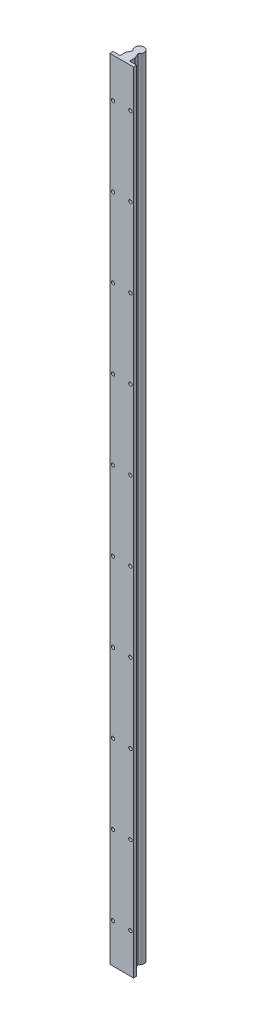
ISO-10303-21;
HEADER;
FILE_DESCRIPTION(('STEP AP214'),'2;1');
FILE_NAME('part.step','',(''),(''),'','','');
FILE_SCHEMA(('AUTOMOTIVE_DESIGN { 1 0 10303 214 1 1 1 1 }'));
ENDSEC;
DATA;
#1=APPLICATION_CONTEXT('core data for automotive mechanical design processes');
#2=APPLICATION_PROTOCOL_DEFINITION('international standard','automotive_design',2000,#1);
#3=PRODUCT_CONTEXT('',#1,'mechanical');
#4=PRODUCT('Part','Part','',(#3));
#5=PRODUCT_RELATED_PRODUCT_CATEGORY('part','',(#4));
#6=PRODUCT_DEFINITION_FORMATION('','',#4);
#7=PRODUCT_DEFINITION_CONTEXT('part definition',#1,'design');
#8=PRODUCT_DEFINITION('design','',#6,#7);
#9=PRODUCT_DEFINITION_SHAPE('','',#8);
#10=(LENGTH_UNIT() NAMED_UNIT(*) SI_UNIT(.MILLI.,.METRE.));
#11=(NAMED_UNIT(*) PLANE_ANGLE_UNIT() SI_UNIT($,.RADIAN.));
#12=(NAMED_UNIT(*) SI_UNIT($,.STERADIAN.) SOLID_ANGLE_UNIT());
#13=UNCERTAINTY_MEASURE_WITH_UNIT(LENGTH_MEASURE(1.E-05),#10,'distance_accuracy_value','');
#14=(GEOMETRIC_REPRESENTATION_CONTEXT(3) GLOBAL_UNCERTAINTY_ASSIGNED_CONTEXT((#13)) GLOBAL_UNIT_ASSIGNED_CONTEXT((#10,
#11,#12)) REPRESENTATION_CONTEXT('',''));
#15=CARTESIAN_POINT('',(0.,0.,0.));
#16=DIRECTION('',(0.,0.,1.));
#17=DIRECTION('',(1.,0.,0.));
#18=AXIS2_PLACEMENT_3D('',#15,#16,#17);
#19=CARTESIAN_POINT('',(-6.,1000.,18.5));
#20=DIRECTION('',(0.,0.,1.));
#21=DIRECTION('',(1.,0.,0.));
#22=AXIS2_PLACEMENT_3D('',#19,#20,#21);
#23=PLANE('',#22);
#24=CARTESIAN_POINT('',(-11.,350.,18.5));
#25=DIRECTION('',(0.,0.,-1.));
#26=DIRECTION('',(-1.,0.,0.));
#27=AXIS2_PLACEMENT_3D('',#24,#25,#26);
#28=CIRCLE('',#27,2.12500000000002);
#29=CARTESIAN_POINT('',(-13.125,350.,18.5));
#30=VERTEX_POINT('',#29);
#31=EDGE_CURVE('E300',#30,#30,#28,.T.);
#32=ORIENTED_EDGE('',*,*,#31,.F.);
#33=EDGE_LOOP('',(#32));
#34=FACE_BOUND('',#33,.T.);
#35=CARTESIAN_POINT('',(-11.,450.,18.5));
#36=DIRECTION('',(0.,0.,-1.));
#37=DIRECTION('',(-1.,0.,0.));
#38=AXIS2_PLACEMENT_3D('',#35,#36,#37);
#39=CIRCLE('',#38,2.12500000000002);
#40=CARTESIAN_POINT('',(-13.125,450.,18.5));
#41=VERTEX_POINT('',#40);
#42=EDGE_CURVE('E288',#41,#41,#39,.T.);
#43=ORIENTED_EDGE('',*,*,#42,.F.);
#44=EDGE_LOOP('',(#43));
#45=FACE_BOUND('',#44,.T.);
#46=CARTESIAN_POINT('',(-11.,150.,18.5));
#47=DIRECTION('',(0.,0.,-1.));
#48=DIRECTION('',(-1.,0.,0.));
#49=AXIS2_PLACEMENT_3D('',#46,#47,#48);
#50=CIRCLE('',#49,2.12500000000002);
#51=CARTESIAN_POINT('',(-13.125,150.,18.5));
#52=VERTEX_POINT('',#51);
#53=EDGE_CURVE('E324',#52,#52,#50,.T.);
#54=ORIENTED_EDGE('',*,*,#53,.F.);
#55=EDGE_LOOP('',(#54));
#56=FACE_BOUND('',#55,.T.);
#57=CARTESIAN_POINT('',(-11.,250.,18.5));
#58=DIRECTION('',(0.,0.,-1.));
#59=DIRECTION('',(-1.,0.,0.));
#60=AXIS2_PLACEMENT_3D('',#57,#58,#59);
#61=CIRCLE('',#60,2.12500000000002);
#62=CARTESIAN_POINT('',(-13.125,250.,18.5));
#63=VERTEX_POINT('',#62);
#64=EDGE_CURVE('E312',#63,#63,#61,.T.);
#65=ORIENTED_EDGE('',*,*,#64,.F.);
#66=EDGE_LOOP('',(#65));
#67=FACE_BOUND('',#66,.T.);
#68=CARTESIAN_POINT('',(-11.,750.,18.5));
#69=DIRECTION('',(0.,0.,-1.));
#70=DIRECTION('',(-1.,0.,0.));
#71=AXIS2_PLACEMENT_3D('',#68,#69,#70);
#72=CIRCLE('',#71,2.12500000000002);
#73=CARTESIAN_POINT('',(-13.125,750.,18.5));
#74=VERTEX_POINT('',#73);
#75=EDGE_CURVE('E252',#74,#74,#72,.T.);
#76=ORIENTED_EDGE('',*,*,#75,.F.);
#77=EDGE_LOOP('',(#76));
#78=FACE_BOUND('',#77,.T.);
#79=CARTESIAN_POINT('',(-11.,850.,18.5));
#80=DIRECTION('',(0.,0.,-1.));
#81=DIRECTION('',(-1.,0.,0.));
#82=AXIS2_PLACEMENT_3D('',#79,#80,#81);
#83=CIRCLE('',#82,2.12500000000002);
#84=CARTESIAN_POINT('',(-13.125,850.,18.5));
#85=VERTEX_POINT('',#84);
#86=EDGE_CURVE('E240',#85,#85,#83,.T.);
#87=ORIENTED_EDGE('',*,*,#86,.F.);
#88=EDGE_LOOP('',(#87));
#89=FACE_BOUND('',#88,.T.);
#90=CARTESIAN_POINT('',(-11.,550.,18.5));
#91=DIRECTION('',(0.,0.,-1.));
#92=DIRECTION('',(-1.,0.,0.));
#93=AXIS2_PLACEMENT_3D('',#90,#91,#92);
#94=CIRCLE('',#93,2.12500000000002);
#95=CARTESIAN_POINT('',(-13.125,550.,18.5));
#96=VERTEX_POINT('',#95);
#97=EDGE_CURVE('E276',#96,#96,#94,.T.);
#98=ORIENTED_EDGE('',*,*,#97,.F.);
#99=EDGE_LOOP('',(#98));
#100=FACE_BOUND('',#99,.T.);
#101=CARTESIAN_POINT('',(-11.,650.,18.5));
#102=DIRECTION('',(0.,0.,-1.));
#103=DIRECTION('',(-1.,0.,0.));
#104=AXIS2_PLACEMENT_3D('',#101,#102,#103);
#105=CIRCLE('',#104,2.12500000000002);
#106=CARTESIAN_POINT('',(-13.125,650.,18.5));
#107=VERTEX_POINT('',#106);
#108=EDGE_CURVE('E264',#107,#107,#105,.T.);
#109=ORIENTED_EDGE('',*,*,#108,.F.);
#110=EDGE_LOOP('',(#109));
#111=FACE_BOUND('',#110,.T.);
#112=CARTESIAN_POINT('',(-11.,49.9999999999999,18.5));
#113=DIRECTION('',(0.,0.,-1.));
#114=DIRECTION('',(-1.,0.,0.));
#115=AXIS2_PLACEMENT_3D('',#112,#113,#114);
#116=CIRCLE('',#115,2.12500000000002);
#117=CARTESIAN_POINT('',(-13.125,49.9999999999999,18.5));
#118=VERTEX_POINT('',#117);
#119=EDGE_CURVE('E329',#118,#118,#116,.T.);
#120=ORIENTED_EDGE('',*,*,#119,.F.);
#121=EDGE_LOOP('',(#120));
#122=FACE_BOUND('',#121,.T.);
#123=CARTESIAN_POINT('',(-11.,950.,18.5));
#124=DIRECTION('',(0.,0.,-1.));
#125=DIRECTION('',(-1.,0.,0.));
#126=AXIS2_PLACEMENT_3D('',#123,#124,#125);
#127=CIRCLE('',#126,2.12500000000002);
#128=CARTESIAN_POINT('',(-13.125,950.,18.5));
#129=VERTEX_POINT('',#128);
#130=EDGE_CURVE('E218',#129,#129,#127,.T.);
#131=ORIENTED_EDGE('',*,*,#130,.F.);
#132=EDGE_LOOP('',(#131));
#133=FACE_BOUND('',#132,.T.);
#134=DIRECTION('',(-1.,0.,0.));
#135=VECTOR('',#134,1.);
#136=CARTESIAN_POINT('',(-6.,0.,18.5));
#137=LINE('',#136,#135);
#138=CARTESIAN_POINT('',(-6.,0.,18.5));
#139=VERTEX_POINT('',#138);
#140=CARTESIAN_POINT('',(-15.,0.,18.5));
#141=VERTEX_POINT('',#140);
#142=EDGE_CURVE('E149',#139,#141,#137,.T.);
#143=ORIENTED_EDGE('',*,*,#142,.T.);
#144=DIRECTION('',(0.,-1.,0.));
#145=VECTOR('',#144,1.);
#146=CARTESIAN_POINT('',(-15.,1000.,18.5));
#147=LINE('',#146,#145);
#148=CARTESIAN_POINT('',(-15.,1000.,18.5));
#149=VERTEX_POINT('',#148);
#150=EDGE_CURVE('E11',#149,#141,#147,.T.);
#151=ORIENTED_EDGE('',*,*,#150,.F.);
#152=DIRECTION('',(-1.,0.,0.));
#153=VECTOR('',#152,1.);
#154=CARTESIAN_POINT('',(-6.,1000.,18.5));
#155=LINE('',#154,#153);
#156=CARTESIAN_POINT('',(-6.,1000.,18.5));
#157=VERTEX_POINT('',#156);
#158=EDGE_CURVE('E168',#157,#149,#155,.T.);
#159=ORIENTED_EDGE('',*,*,#158,.F.);
#160=DIRECTION('',(0.,-1.,0.));
#161=VECTOR('',#160,1.);
#162=CARTESIAN_POINT('',(-6.,1000.,18.5));
#163=LINE('',#162,#161);
#164=EDGE_CURVE('E145',#157,#139,#163,.T.);
#165=ORIENTED_EDGE('',*,*,#164,.T.);
#166=EDGE_LOOP('',(#143,#151,#159,#165));
#167=FACE_BOUND('',#166,.T.);
#168=ADVANCED_FACE('F41',(#34,#45,#56,#67,#78,#89,#100,#111,#122,#133,#167),#23,.F.);
#169=CARTESIAN_POINT('',(-15.,1000.,22.5));
#170=DIRECTION('',(1.,0.,0.));
#171=DIRECTION('',(0.,0.,-1.));
#172=AXIS2_PLACEMENT_3D('',#169,#170,#171);
#173=PLANE('',#172);
#174=DIRECTION('',(0.,0.,1.));
#175=VECTOR('',#174,1.);
#176=CARTESIAN_POINT('',(-15.,0.,22.5));
#177=LINE('',#176,#175);
#178=CARTESIAN_POINT('',(-15.,0.,22.5));
#179=VERTEX_POINT('',#178);
#180=EDGE_CURVE('E152',#141,#179,#177,.T.);
#181=ORIENTED_EDGE('',*,*,#180,.T.);
#182=DIRECTION('',(0.,-1.,0.));
#183=VECTOR('',#182,1.);
#184=CARTESIAN_POINT('',(-15.,1000.,22.5));
#185=LINE('',#184,#183);
#186=CARTESIAN_POINT('',(-15.,1000.,22.5));
#187=VERTEX_POINT('',#186);
#188=EDGE_CURVE('E49',#187,#179,#185,.T.);
#189=ORIENTED_EDGE('',*,*,#188,.F.);
#190=DIRECTION('',(0.,0.,1.));
#191=VECTOR('',#190,1.);
#192=CARTESIAN_POINT('',(-15.,1000.,22.5));
#193=LINE('',#192,#191);
#194=EDGE_CURVE('E106',#149,#187,#193,.T.);
#195=ORIENTED_EDGE('',*,*,#194,.F.);
#196=ORIENTED_EDGE('',*,*,#150,.T.);
#197=EDGE_LOOP('',(#181,#189,#195,#196));
#198=FACE_BOUND('',#197,.T.);
#199=ADVANCED_FACE('F347',(#198),#173,.F.);
#200=CARTESIAN_POINT('',(15.,1000.,22.5));
#201=DIRECTION('',(0.,0.,-1.));
#202=DIRECTION('',(-1.,0.,0.));
#203=AXIS2_PLACEMENT_3D('',#200,#201,#202);
#204=PLANE('',#203);
#205=CARTESIAN_POINT('',(11.,250.,22.5));
#206=DIRECTION('',(0.,0.,-1.));
#207=DIRECTION('',(-1.,0.,0.));
#208=AXIS2_PLACEMENT_3D('',#205,#206,#207);
#209=CIRCLE('',#208,2.12500000000002);
#210=CARTESIAN_POINT('',(8.87499999999998,250.,22.5));
#211=VERTEX_POINT('',#210);
#212=EDGE_CURVE('E296',#211,#211,#209,.T.);
#213=ORIENTED_EDGE('',*,*,#212,.T.);
#214=EDGE_LOOP('',(#213));
#215=FACE_BOUND('',#214,.T.);
#216=CARTESIAN_POINT('',(-11.,350.,22.5));
#217=DIRECTION('',(0.,0.,-1.));
#218=DIRECTION('',(-1.,0.,0.));
#219=AXIS2_PLACEMENT_3D('',#216,#217,#218);
#220=CIRCLE('',#219,2.12500000000002);
#221=CARTESIAN_POINT('',(-13.125,350.,22.5));
#222=VERTEX_POINT('',#221);
#223=EDGE_CURVE('E285',#222,#222,#220,.T.);
#224=ORIENTED_EDGE('',*,*,#223,.T.);
#225=EDGE_LOOP('',(#224));
#226=FACE_BOUND('',#225,.T.);
#227=CARTESIAN_POINT('',(11.,350.,22.5));
#228=DIRECTION('',(0.,0.,-1.));
#229=DIRECTION('',(-1.,0.,0.));
#230=AXIS2_PLACEMENT_3D('',#227,#228,#229);
#231=CIRCLE('',#230,2.12500000000002);
#232=CARTESIAN_POINT('',(8.87499999999998,350.,22.5));
#233=VERTEX_POINT('',#232);
#234=EDGE_CURVE('E284',#233,#233,#231,.T.);
#235=ORIENTED_EDGE('',*,*,#234,.T.);
#236=EDGE_LOOP('',(#235));
#237=FACE_BOUND('',#236,.T.);
#238=CARTESIAN_POINT('',(-11.,450.,22.5));
#239=DIRECTION('',(0.,0.,-1.));
#240=DIRECTION('',(-1.,0.,0.));
#241=AXIS2_PLACEMENT_3D('',#238,#239,#240);
#242=CIRCLE('',#241,2.12500000000002);
#243=CARTESIAN_POINT('',(-13.125,450.,22.5));
#244=VERTEX_POINT('',#243);
#245=EDGE_CURVE('E273',#244,#244,#242,.T.);
#246=ORIENTED_EDGE('',*,*,#245,.T.);
#247=EDGE_LOOP('',(#246));
#248=FACE_BOUND('',#247,.T.);
#249=CARTESIAN_POINT('',(11.,49.9999999999999,22.5));
#250=DIRECTION('',(0.,0.,-1.));
#251=DIRECTION('',(-1.,0.,0.));
#252=AXIS2_PLACEMENT_3D('',#249,#250,#251);
#253=CIRCLE('',#252,2.12500000000002);
#254=CARTESIAN_POINT('',(8.87499999999998,49.9999999999999,22.5));
#255=VERTEX_POINT('',#254);
#256=EDGE_CURVE('E320',#255,#255,#253,.T.);
#257=ORIENTED_EDGE('',*,*,#256,.T.);
#258=EDGE_LOOP('',(#257));
#259=FACE_BOUND('',#258,.T.);
#260=CARTESIAN_POINT('',(-11.,150.,22.5));
#261=DIRECTION('',(0.,0.,-1.));
#262=DIRECTION('',(-1.,0.,0.));
#263=AXIS2_PLACEMENT_3D('',#260,#261,#262);
#264=CIRCLE('',#263,2.12500000000002);
#265=CARTESIAN_POINT('',(-13.125,150.,22.5));
#266=VERTEX_POINT('',#265);
#267=EDGE_CURVE('E309',#266,#266,#264,.T.);
#268=ORIENTED_EDGE('',*,*,#267,.T.);
#269=EDGE_LOOP('',(#268));
#270=FACE_BOUND('',#269,.T.);
#271=CARTESIAN_POINT('',(11.,150.,22.5));
#272=DIRECTION('',(0.,0.,-1.));
#273=DIRECTION('',(-1.,0.,0.));
#274=AXIS2_PLACEMENT_3D('',#271,#272,#273);
#275=CIRCLE('',#274,2.12500000000002);
#276=CARTESIAN_POINT('',(8.87499999999998,150.,22.5));
#277=VERTEX_POINT('',#276);
#278=EDGE_CURVE('E308',#277,#277,#275,.T.);
#279=ORIENTED_EDGE('',*,*,#278,.T.);
#280=EDGE_LOOP('',(#279));
#281=FACE_BOUND('',#280,.T.);
#282=CARTESIAN_POINT('',(-11.,250.,22.5));
#283=DIRECTION('',(0.,0.,-1.));
#284=DIRECTION('',(-1.,0.,0.));
#285=AXIS2_PLACEMENT_3D('',#282,#283,#284);
#286=CIRCLE('',#285,2.12500000000002);
#287=CARTESIAN_POINT('',(-13.125,250.,22.5));
#288=VERTEX_POINT('',#287);
#289=EDGE_CURVE('E297',#288,#288,#286,.T.);
#290=ORIENTED_EDGE('',*,*,#289,.T.);
#291=EDGE_LOOP('',(#290));
#292=FACE_BOUND('',#291,.T.);
#293=CARTESIAN_POINT('',(11.,650.,22.5));
#294=DIRECTION('',(0.,0.,-1.));
#295=DIRECTION('',(-1.,0.,0.));
#296=AXIS2_PLACEMENT_3D('',#293,#294,#295);
#297=CIRCLE('',#296,2.12500000000002);
#298=CARTESIAN_POINT('',(8.87499999999998,650.,22.5));
#299=VERTEX_POINT('',#298);
#300=EDGE_CURVE('E248',#299,#299,#297,.T.);
#301=ORIENTED_EDGE('',*,*,#300,.T.);
#302=EDGE_LOOP('',(#301));
#303=FACE_BOUND('',#302,.T.);
#304=CARTESIAN_POINT('',(-11.,750.,22.5));
#305=DIRECTION('',(0.,0.,-1.));
#306=DIRECTION('',(-1.,0.,0.));
#307=AXIS2_PLACEMENT_3D('',#304,#305,#306);
#308=CIRCLE('',#307,2.12500000000002);
#309=CARTESIAN_POINT('',(-13.125,750.,22.5));
#310=VERTEX_POINT('',#309);
#311=EDGE_CURVE('E237',#310,#310,#308,.T.);
#312=ORIENTED_EDGE('',*,*,#311,.T.);
#313=EDGE_LOOP('',(#312));
#314=FACE_BOUND('',#313,.T.);
#315=CARTESIAN_POINT('',(11.,750.,22.5));
#316=DIRECTION('',(0.,0.,-1.));
#317=DIRECTION('',(-1.,0.,0.));
#318=AXIS2_PLACEMENT_3D('',#315,#316,#317);
#319=CIRCLE('',#318,2.12500000000002);
#320=CARTESIAN_POINT('',(8.87499999999998,750.,22.5));
#321=VERTEX_POINT('',#320);
#322=EDGE_CURVE('E236',#321,#321,#319,.T.);
#323=ORIENTED_EDGE('',*,*,#322,.T.);
#324=EDGE_LOOP('',(#323));
#325=FACE_BOUND('',#324,.T.);
#326=CARTESIAN_POINT('',(-11.,850.,22.5));
#327=DIRECTION('',(0.,0.,-1.));
#328=DIRECTION('',(-1.,0.,0.));
#329=AXIS2_PLACEMENT_3D('',#326,#327,#328);
#330=CIRCLE('',#329,2.12500000000002);
#331=CARTESIAN_POINT('',(-13.125,850.,22.5));
#332=VERTEX_POINT('',#331);
#333=EDGE_CURVE('E230',#332,#332,#330,.T.);
#334=ORIENTED_EDGE('',*,*,#333,.T.);
#335=EDGE_LOOP('',(#334));
#336=FACE_BOUND('',#335,.T.);
#337=CARTESIAN_POINT('',(11.,450.,22.5));
#338=DIRECTION('',(0.,0.,-1.));
#339=DIRECTION('',(-1.,0.,0.));
#340=AXIS2_PLACEMENT_3D('',#337,#338,#339);
#341=CIRCLE('',#340,2.12500000000002);
#342=CARTESIAN_POINT('',(8.87499999999998,450.,22.5));
#343=VERTEX_POINT('',#342);
#344=EDGE_CURVE('E272',#343,#343,#341,.T.);
#345=ORIENTED_EDGE('',*,*,#344,.T.);
#346=EDGE_LOOP('',(#345));
#347=FACE_BOUND('',#346,.T.);
#348=CARTESIAN_POINT('',(-11.,550.,22.5));
#349=DIRECTION('',(0.,0.,-1.));
#350=DIRECTION('',(-1.,0.,0.));
#351=AXIS2_PLACEMENT_3D('',#348,#349,#350);
#352=CIRCLE('',#351,2.12500000000002);
#353=CARTESIAN_POINT('',(-13.125,550.,22.5));
#354=VERTEX_POINT('',#353);
#355=EDGE_CURVE('E261',#354,#354,#352,.T.);
#356=ORIENTED_EDGE('',*,*,#355,.T.);
#357=EDGE_LOOP('',(#356));
#358=FACE_BOUND('',#357,.T.);
#359=CARTESIAN_POINT('',(11.,550.,22.5));
#360=DIRECTION('',(0.,0.,-1.));
#361=DIRECTION('',(-1.,0.,0.));
#362=AXIS2_PLACEMENT_3D('',#359,#360,#361);
#363=CIRCLE('',#362,2.12500000000002);
#364=CARTESIAN_POINT('',(8.87499999999998,550.,22.5));
#365=VERTEX_POINT('',#364);
#366=EDGE_CURVE('E260',#365,#365,#363,.T.);
#367=ORIENTED_EDGE('',*,*,#366,.T.);
#368=EDGE_LOOP('',(#367));
#369=FACE_BOUND('',#368,.T.);
#370=CARTESIAN_POINT('',(-11.,650.,22.5));
#371=DIRECTION('',(0.,0.,-1.));
#372=DIRECTION('',(-1.,0.,0.));
#373=AXIS2_PLACEMENT_3D('',#370,#371,#372);
#374=CIRCLE('',#373,2.12500000000002);
#375=CARTESIAN_POINT('',(-13.125,650.,22.5));
#376=VERTEX_POINT('',#375);
#377=EDGE_CURVE('E249',#376,#376,#374,.T.);
#378=ORIENTED_EDGE('',*,*,#377,.T.);
#379=EDGE_LOOP('',(#378));
#380=FACE_BOUND('',#379,.T.);
#381=CARTESIAN_POINT('',(-11.,49.9999999999999,22.5));
#382=DIRECTION('',(0.,0.,-1.));
#383=DIRECTION('',(-1.,0.,0.));
#384=AXIS2_PLACEMENT_3D('',#381,#382,#383);
#385=CIRCLE('',#384,2.12500000000002);
#386=CARTESIAN_POINT('',(-13.125,49.9999999999999,22.5));
#387=VERTEX_POINT('',#386);
#388=EDGE_CURVE('E321',#387,#387,#385,.T.);
#389=ORIENTED_EDGE('',*,*,#388,.T.);
#390=EDGE_LOOP('',(#389));
#391=FACE_BOUND('',#390,.T.);
#392=CARTESIAN_POINT('',(11.,850.,22.5));
#393=DIRECTION('',(0.,0.,-1.));
#394=DIRECTION('',(-1.,0.,0.));
#395=AXIS2_PLACEMENT_3D('',#392,#393,#394);
#396=CIRCLE('',#395,2.12500000000002);
#397=CARTESIAN_POINT('',(8.87499999999998,850.,22.5));
#398=VERTEX_POINT('',#397);
#399=EDGE_CURVE('E219',#398,#398,#396,.T.);
#400=ORIENTED_EDGE('',*,*,#399,.T.);
#401=EDGE_LOOP('',(#400));
#402=FACE_BOUND('',#401,.T.);
#403=CARTESIAN_POINT('',(11.,950.,22.5));
#404=DIRECTION('',(0.,0.,-1.));
#405=DIRECTION('',(-1.,0.,0.));
#406=AXIS2_PLACEMENT_3D('',#403,#404,#405);
#407=CIRCLE('',#406,2.12500000000002);
#408=CARTESIAN_POINT('',(8.87499999999998,950.,22.5));
#409=VERTEX_POINT('',#408);
#410=EDGE_CURVE('E153',#409,#409,#407,.T.);
#411=ORIENTED_EDGE('',*,*,#410,.T.);
#412=EDGE_LOOP('',(#411));
#413=FACE_BOUND('',#412,.T.);
#414=CARTESIAN_POINT('',(-11.,950.,22.5));
#415=DIRECTION('',(0.,0.,-1.));
#416=DIRECTION('',(-1.,0.,0.));
#417=AXIS2_PLACEMENT_3D('',#414,#415,#416);
#418=CIRCLE('',#417,2.12500000000002);
#419=CARTESIAN_POINT('',(-13.125,950.,22.5));
#420=VERTEX_POINT('',#419);
#421=EDGE_CURVE('E215',#420,#420,#418,.T.);
#422=ORIENTED_EDGE('',*,*,#421,.T.);
#423=EDGE_LOOP('',(#422));
#424=FACE_BOUND('',#423,.T.);
#425=DIRECTION('',(1.,0.,0.));
#426=VECTOR('',#425,1.);
#427=CARTESIAN_POINT('',(15.,0.,22.5));
#428=LINE('',#427,#426);
#429=CARTESIAN_POINT('',(15.,0.,22.5));
#430=VERTEX_POINT('',#429);
#431=EDGE_CURVE('E155',#179,#430,#428,.T.);
#432=ORIENTED_EDGE('',*,*,#431,.T.);
#433=DIRECTION('',(0.,-1.,0.));
#434=VECTOR('',#433,1.);
#435=CARTESIAN_POINT('',(15.,1000.,22.5));
#436=LINE('',#435,#434);
#437=CARTESIAN_POINT('',(15.,1000.,22.5));
#438=VERTEX_POINT('',#437);
#439=EDGE_CURVE('E181',#438,#430,#436,.T.);
#440=ORIENTED_EDGE('',*,*,#439,.F.);
#441=DIRECTION('',(1.,0.,0.));
#442=VECTOR('',#441,1.);
#443=CARTESIAN_POINT('',(15.,1000.,22.5));
#444=LINE('',#443,#442);
#445=EDGE_CURVE('E189',#187,#438,#444,.T.);
#446=ORIENTED_EDGE('',*,*,#445,.F.);
#447=ORIENTED_EDGE('',*,*,#188,.T.);
#448=EDGE_LOOP('',(#432,#440,#446,#447));
#449=FACE_BOUND('',#448,.T.);
#450=ADVANCED_FACE('F187',(#215,#226,#237,#248,#259,#270,#281,#292,#303,#314,#325,#336,#347,
#358,#369,#380,#391,#402,#413,#424,#449),#204,.F.);
#451=CARTESIAN_POINT('',(15.,1000.,22.5));
#452=DIRECTION('',(-1.,0.,0.));
#453=DIRECTION('',(0.,0.,1.));
#454=AXIS2_PLACEMENT_3D('',#451,#452,#453);
#455=PLANE('',#454);
#456=DIRECTION('',(0.,0.,-1.));
#457=VECTOR('',#456,1.);
#458=CARTESIAN_POINT('',(15.,0.,22.5));
#459=LINE('',#458,#457);
#460=CARTESIAN_POINT('',(15.,0.,18.5));
#461=VERTEX_POINT('',#460);
#462=EDGE_CURVE('E157',#430,#461,#459,.T.);
#463=ORIENTED_EDGE('',*,*,#462,.T.);
#464=DIRECTION('',(0.,-1.,0.));
#465=VECTOR('',#464,1.);
#466=CARTESIAN_POINT('',(15.,1000.,18.5));
#467=LINE('',#466,#465);
#468=CARTESIAN_POINT('',(15.,1000.,18.5));
#469=VERTEX_POINT('',#468);
#470=EDGE_CURVE('E178',#469,#461,#467,.T.);
#471=ORIENTED_EDGE('',*,*,#470,.F.);
#472=DIRECTION('',(0.,0.,-1.));
#473=VECTOR('',#472,1.);
#474=CARTESIAN_POINT('',(15.,1000.,22.5));
#475=LINE('',#474,#473);
#476=EDGE_CURVE('E207',#438,#469,#475,.T.);
#477=ORIENTED_EDGE('',*,*,#476,.F.);
#478=ORIENTED_EDGE('',*,*,#439,.T.);
#479=EDGE_LOOP('',(#463,#471,#477,#478));
#480=FACE_BOUND('',#479,.T.);
#481=ADVANCED_FACE('F198',(#480),#455,.F.);
#482=CARTESIAN_POINT('',(15.,1000.,18.5));
#483=DIRECTION('',(0.,0.,1.));
#484=DIRECTION('',(1.,0.,0.));
#485=AXIS2_PLACEMENT_3D('',#482,#483,#484);
#486=PLANE('',#485);
#487=CARTESIAN_POINT('',(11.,250.,18.5));
#488=DIRECTION('',(0.,0.,-1.));
#489=DIRECTION('',(-1.,0.,0.));
#490=AXIS2_PLACEMENT_3D('',#487,#488,#489);
#491=CIRCLE('',#490,2.12500000000002);
#492=CARTESIAN_POINT('',(8.87499999999998,250.,18.5));
#493=VERTEX_POINT('',#492);
#494=EDGE_CURVE('E293',#493,#493,#491,.T.);
#495=ORIENTED_EDGE('',*,*,#494,.F.);
#496=EDGE_LOOP('',(#495));
#497=FACE_BOUND('',#496,.T.);
#498=CARTESIAN_POINT('',(11.,350.,18.5));
#499=DIRECTION('',(0.,0.,-1.));
#500=DIRECTION('',(-1.,0.,0.));
#501=AXIS2_PLACEMENT_3D('',#498,#499,#500);
#502=CIRCLE('',#501,2.12500000000002);
#503=CARTESIAN_POINT('',(8.87499999999998,350.,18.5));
#504=VERTEX_POINT('',#503);
#505=EDGE_CURVE('E281',#504,#504,#502,.T.);
#506=ORIENTED_EDGE('',*,*,#505,.F.);
#507=EDGE_LOOP('',(#506));
#508=FACE_BOUND('',#507,.T.);
#509=CARTESIAN_POINT('',(11.,49.9999999999999,18.5));
#510=DIRECTION('',(0.,0.,-1.));
#511=DIRECTION('',(-1.,0.,0.));
#512=AXIS2_PLACEMENT_3D('',#509,#510,#511);
#513=CIRCLE('',#512,2.12500000000002);
#514=CARTESIAN_POINT('',(8.87499999999998,49.9999999999999,18.5));
#515=VERTEX_POINT('',#514);
#516=EDGE_CURVE('E317',#515,#515,#513,.T.);
#517=ORIENTED_EDGE('',*,*,#516,.F.);
#518=EDGE_LOOP('',(#517));
#519=FACE_BOUND('',#518,.T.);
#520=CARTESIAN_POINT('',(11.,150.,18.5));
#521=DIRECTION('',(0.,0.,-1.));
#522=DIRECTION('',(-1.,0.,0.));
#523=AXIS2_PLACEMENT_3D('',#520,#521,#522);
#524=CIRCLE('',#523,2.12500000000002);
#525=CARTESIAN_POINT('',(8.87499999999998,150.,18.5));
#526=VERTEX_POINT('',#525);
#527=EDGE_CURVE('E305',#526,#526,#524,.T.);
#528=ORIENTED_EDGE('',*,*,#527,.F.);
#529=EDGE_LOOP('',(#528));
#530=FACE_BOUND('',#529,.T.);
#531=CARTESIAN_POINT('',(11.,650.,18.5));
#532=DIRECTION('',(0.,0.,-1.));
#533=DIRECTION('',(-1.,0.,0.));
#534=AXIS2_PLACEMENT_3D('',#531,#532,#533);
#535=CIRCLE('',#534,2.12500000000002);
#536=CARTESIAN_POINT('',(8.87499999999998,650.,18.5));
#537=VERTEX_POINT('',#536);
#538=EDGE_CURVE('E245',#537,#537,#535,.T.);
#539=ORIENTED_EDGE('',*,*,#538,.F.);
#540=EDGE_LOOP('',(#539));
#541=FACE_BOUND('',#540,.T.);
#542=CARTESIAN_POINT('',(11.,750.,18.5));
#543=DIRECTION('',(0.,0.,-1.));
#544=DIRECTION('',(-1.,0.,0.));
#545=AXIS2_PLACEMENT_3D('',#542,#543,#544);
#546=CIRCLE('',#545,2.12500000000002);
#547=CARTESIAN_POINT('',(8.87499999999998,750.,18.5));
#548=VERTEX_POINT('',#547);
#549=EDGE_CURVE('E233',#548,#548,#546,.T.);
#550=ORIENTED_EDGE('',*,*,#549,.F.);
#551=EDGE_LOOP('',(#550));
#552=FACE_BOUND('',#551,.T.);
#553=CARTESIAN_POINT('',(11.,450.,18.5));
#554=DIRECTION('',(0.,0.,-1.));
#555=DIRECTION('',(-1.,0.,0.));
#556=AXIS2_PLACEMENT_3D('',#553,#554,#555);
#557=CIRCLE('',#556,2.12500000000002);
#558=CARTESIAN_POINT('',(8.87499999999998,450.,18.5));
#559=VERTEX_POINT('',#558);
#560=EDGE_CURVE('E269',#559,#559,#557,.T.);
#561=ORIENTED_EDGE('',*,*,#560,.F.);
#562=EDGE_LOOP('',(#561));
#563=FACE_BOUND('',#562,.T.);
#564=CARTESIAN_POINT('',(11.,550.,18.5));
#565=DIRECTION('',(0.,0.,-1.));
#566=DIRECTION('',(-1.,0.,0.));
#567=AXIS2_PLACEMENT_3D('',#564,#565,#566);
#568=CIRCLE('',#567,2.12500000000002);
#569=CARTESIAN_POINT('',(8.87499999999998,550.,18.5));
#570=VERTEX_POINT('',#569);
#571=EDGE_CURVE('E257',#570,#570,#568,.T.);
#572=ORIENTED_EDGE('',*,*,#571,.F.);
#573=EDGE_LOOP('',(#572));
#574=FACE_BOUND('',#573,.T.);
#575=CARTESIAN_POINT('',(11.,850.,18.5));
#576=DIRECTION('',(0.,0.,-1.));
#577=DIRECTION('',(-1.,0.,0.));
#578=AXIS2_PLACEMENT_3D('',#575,#576,#577);
#579=CIRCLE('',#578,2.12500000000002);
#580=CARTESIAN_POINT('',(8.87499999999998,850.,18.5));
#581=VERTEX_POINT('',#580);
#582=EDGE_CURVE('E227',#581,#581,#579,.T.);
#583=ORIENTED_EDGE('',*,*,#582,.F.);
#584=EDGE_LOOP('',(#583));
#585=FACE_BOUND('',#584,.T.);
#586=CARTESIAN_POINT('',(11.,950.,18.5));
#587=DIRECTION('',(0.,0.,-1.));
#588=DIRECTION('',(-1.,0.,0.));
#589=AXIS2_PLACEMENT_3D('',#586,#587,#588);
#590=CIRCLE('',#589,2.12500000000002);
#591=CARTESIAN_POINT('',(8.87499999999998,950.,18.5));
#592=VERTEX_POINT('',#591);
#593=EDGE_CURVE('E222',#592,#592,#590,.T.);
#594=ORIENTED_EDGE('',*,*,#593,.F.);
#595=EDGE_LOOP('',(#594));
#596=FACE_BOUND('',#595,.T.);
#597=DIRECTION('',(-1.,0.,0.));
#598=VECTOR('',#597,1.);
#599=CARTESIAN_POINT('',(15.,0.,18.5));
#600=LINE('',#599,#598);
#601=CARTESIAN_POINT('',(6.,0.,18.5));
#602=VERTEX_POINT('',#601);
#603=EDGE_CURVE('E159',#461,#602,#600,.T.);
#604=ORIENTED_EDGE('',*,*,#603,.T.);
#605=DIRECTION('',(0.,-1.,0.));
#606=VECTOR('',#605,1.);
#607=CARTESIAN_POINT('',(6.,1000.,18.5));
#608=LINE('',#607,#606);
#609=CARTESIAN_POINT('',(6.,1000.,18.5));
#610=VERTEX_POINT('',#609);
#611=EDGE_CURVE('E175',#610,#602,#608,.T.);
#612=ORIENTED_EDGE('',*,*,#611,.F.);
#613=DIRECTION('',(-1.,0.,0.));
#614=VECTOR('',#613,1.);
#615=CARTESIAN_POINT('',(15.,1000.,18.5));
#616=LINE('',#615,#614);
#617=EDGE_CURVE('E204',#469,#610,#616,.T.);
#618=ORIENTED_EDGE('',*,*,#617,.F.);
#619=ORIENTED_EDGE('',*,*,#470,.T.);
#620=EDGE_LOOP('',(#604,#612,#618,#619));
#621=FACE_BOUND('',#620,.T.);
#622=ADVANCED_FACE('F202',(#497,#508,#519,#530,#541,#552,#563,#574,#585,#596,#621),#486,.F.);
#623=CARTESIAN_POINT('',(6.,1000.,18.5));
#624=DIRECTION('',(-1.,0.,0.));
#625=DIRECTION('',(0.,0.,1.));
#626=AXIS2_PLACEMENT_3D('',#623,#624,#625);
#627=PLANE('',#626);
#628=DIRECTION('',(0.,0.,-1.));
#629=VECTOR('',#628,1.);
#630=CARTESIAN_POINT('',(6.,0.,18.5));
#631=LINE('',#630,#629);
#632=CARTESIAN_POINT('',(6.,0.,11.5));
#633=VERTEX_POINT('',#632);
#634=EDGE_CURVE('E161',#602,#633,#631,.T.);
#635=ORIENTED_EDGE('',*,*,#634,.T.);
#636=DIRECTION('',(0.,-1.,0.));
#637=VECTOR('',#636,1.);
#638=CARTESIAN_POINT('',(6.,1000.,11.5));
#639=LINE('',#638,#637);
#640=CARTESIAN_POINT('',(6.,1000.,11.5));
#641=VERTEX_POINT('',#640);
#642=EDGE_CURVE('E172',#641,#633,#639,.T.);
#643=ORIENTED_EDGE('',*,*,#642,.F.);
#644=DIRECTION('',(0.,0.,-1.));
#645=VECTOR('',#644,1.);
#646=CARTESIAN_POINT('',(6.,1000.,18.5));
#647=LINE('',#646,#645);
#648=EDGE_CURVE('E206',#610,#641,#647,.T.);
#649=ORIENTED_EDGE('',*,*,#648,.F.);
#650=ORIENTED_EDGE('',*,*,#611,.T.);
#651=EDGE_LOOP('',(#635,#643,#649,#650));
#652=FACE_BOUND('',#651,.T.);
#653=ADVANCED_FACE('F358',(#652),#627,.F.);
#654=CARTESIAN_POINT('',(3.25,1000.,5.043560250458));
#655=DIRECTION('',(-0.92002218494726,0.,0.391866277197808));
#656=DIRECTION('',(0.391866277197808,0.,0.92002218494726));
#657=AXIS2_PLACEMENT_3D('',#654,#655,#656);
#658=PLANE('',#657);
#659=DIRECTION('',(-0.391866277197808,0.,-0.92002218494726));
#660=VECTOR('',#659,1.);
#661=CARTESIAN_POINT('',(3.25,0.,5.043560250458));
#662=LINE('',#661,#660);
#663=CARTESIAN_POINT('',(3.25,0.,5.043560250458));
#664=VERTEX_POINT('',#663);
#665=EDGE_CURVE('E163',#633,#664,#662,.T.);
#666=ORIENTED_EDGE('',*,*,#665,.T.);
#667=DIRECTION('',(0.,-1.,0.));
#668=VECTOR('',#667,1.);
#669=CARTESIAN_POINT('',(3.25,1000.,5.043560250458));
#670=LINE('',#669,#668);
#671=CARTESIAN_POINT('',(3.25,1000.,5.043560250458));
#672=VERTEX_POINT('',#671);
#673=EDGE_CURVE('E140',#672,#664,#670,.T.);
#674=ORIENTED_EDGE('',*,*,#673,.F.);
#675=DIRECTION('',(-0.391866277197808,0.,-0.92002218494726));
#676=VECTOR('',#675,1.);
#677=CARTESIAN_POINT('',(3.25,1000.,5.043560250458));
#678=LINE('',#677,#676);
#679=EDGE_CURVE('E131',#641,#672,#678,.T.);
#680=ORIENTED_EDGE('',*,*,#679,.F.);
#681=ORIENTED_EDGE('',*,*,#642,.T.);
#682=EDGE_LOOP('',(#666,#674,#680,#681));
#683=FACE_BOUND('',#682,.T.);
#684=ADVANCED_FACE('F355',(#683),#658,.F.);
#685=CARTESIAN_POINT('',(0.,1000.,0.));
#686=DIRECTION('',(0.,-1.,0.));
#687=DIRECTION('',(0.,0.,-1.));
#688=AXIS2_PLACEMENT_3D('',#685,#686,#687);
#689=CYLINDRICAL_SURFACE('',#688,6.);
#690=CARTESIAN_POINT('',(0.,0.,0.));
#691=DIRECTION('',(0.,1.,0.));
#692=DIRECTION('',(0.,0.,1.));
#693=AXIS2_PLACEMENT_3D('',#690,#691,#692);
#694=CIRCLE('',#693,6.);
#695=CARTESIAN_POINT('',(-3.25,0.,5.043560250458));
#696=VERTEX_POINT('',#695);
#697=EDGE_CURVE('E139',#664,#696,#694,.T.);
#698=ORIENTED_EDGE('',*,*,#697,.T.);
#699=DIRECTION('',(0.,-1.,0.));
#700=VECTOR('',#699,1.);
#701=CARTESIAN_POINT('',(-3.25,1000.,5.043560250458));
#702=LINE('',#701,#700);
#703=CARTESIAN_POINT('',(-3.25,1000.,5.043560250458));
#704=VERTEX_POINT('',#703);
#705=EDGE_CURVE('E136',#704,#696,#702,.T.);
#706=ORIENTED_EDGE('',*,*,#705,.F.);
#707=CARTESIAN_POINT('',(0.,1000.,0.));
#708=DIRECTION('',(0.,1.,0.));
#709=DIRECTION('',(0.,0.,1.));
#710=AXIS2_PLACEMENT_3D('',#707,#708,#709);
#711=CIRCLE('',#710,6.);
#712=EDGE_CURVE('E125',#672,#704,#711,.T.);
#713=ORIENTED_EDGE('',*,*,#712,.F.);
#714=ORIENTED_EDGE('',*,*,#673,.T.);
#715=EDGE_LOOP('',(#698,#706,#713,#714));
#716=FACE_BOUND('',#715,.T.);
#717=ADVANCED_FACE('F137',(#716),#689,.T.);
#718=CARTESIAN_POINT('',(-6.,1000.,11.5));
#719=DIRECTION('',(0.920022184947261,0.,0.391866277197807));
#720=DIRECTION('',(0.391866277197807,0.,-0.920022184947261));
#721=AXIS2_PLACEMENT_3D('',#718,#719,#720);
#722=PLANE('',#721);
#723=DIRECTION('',(-0.391866277197807,0.,0.920022184947261));
#724=VECTOR('',#723,1.);
#725=CARTESIAN_POINT('',(-6.,0.,11.5));
#726=LINE('',#725,#724);
#727=CARTESIAN_POINT('',(-6.,0.,11.5));
#728=VERTEX_POINT('',#727);
#729=EDGE_CURVE('E92',#696,#728,#726,.T.);
#730=ORIENTED_EDGE('',*,*,#729,.T.);
#731=DIRECTION('',(0.,-1.,0.));
#732=VECTOR('',#731,1.);
#733=CARTESIAN_POINT('',(-6.,1000.,11.5));
#734=LINE('',#733,#732);
#735=CARTESIAN_POINT('',(-6.,1000.,11.5));
#736=VERTEX_POINT('',#735);
#737=EDGE_CURVE('E141',#736,#728,#734,.T.);
#738=ORIENTED_EDGE('',*,*,#737,.F.);
#739=DIRECTION('',(-0.391866277197807,0.,0.920022184947261));
#740=VECTOR('',#739,1.);
#741=CARTESIAN_POINT('',(-6.,1000.,11.5));
#742=LINE('',#741,#740);
#743=EDGE_CURVE('E129',#704,#736,#742,.T.);
#744=ORIENTED_EDGE('',*,*,#743,.F.);
#745=ORIENTED_EDGE('',*,*,#705,.T.);
#746=EDGE_LOOP('',(#730,#738,#744,#745));
#747=FACE_BOUND('',#746,.T.);
#748=ADVANCED_FACE('F143',(#747),#722,.F.);
#749=CARTESIAN_POINT('',(-6.,1000.,18.5));
#750=DIRECTION('',(1.,0.,0.));
#751=DIRECTION('',(0.,0.,-1.));
#752=AXIS2_PLACEMENT_3D('',#749,#750,#751);
#753=PLANE('',#752);
#754=DIRECTION('',(0.,0.,1.));
#755=VECTOR('',#754,1.);
#756=CARTESIAN_POINT('',(-6.,0.,18.5));
#757=LINE('',#756,#755);
#758=EDGE_CURVE('E98',#728,#139,#757,.T.);
#759=ORIENTED_EDGE('',*,*,#758,.T.);
#760=ORIENTED_EDGE('',*,*,#164,.F.);
#761=DIRECTION('',(0.,0.,1.));
#762=VECTOR('',#761,1.);
#763=CARTESIAN_POINT('',(-6.,1000.,18.5));
#764=LINE('',#763,#762);
#765=EDGE_CURVE('E57',#736,#157,#764,.T.);
#766=ORIENTED_EDGE('',*,*,#765,.F.);
#767=ORIENTED_EDGE('',*,*,#737,.T.);
#768=EDGE_LOOP('',(#759,#760,#766,#767));
#769=FACE_BOUND('',#768,.T.);
#770=ADVANCED_FACE('F654',(#769),#753,.F.);
#771=CARTESIAN_POINT('',(0.,1000.,0.));
#772=DIRECTION('',(0.,1.,0.));
#773=DIRECTION('',(0.,0.,1.));
#774=AXIS2_PLACEMENT_3D('',#771,#772,#773);
#775=PLANE('',#774);
#776=ORIENTED_EDGE('',*,*,#158,.T.);
#777=ORIENTED_EDGE('',*,*,#194,.T.);
#778=ORIENTED_EDGE('',*,*,#445,.T.);
#779=ORIENTED_EDGE('',*,*,#476,.T.);
#780=ORIENTED_EDGE('',*,*,#617,.T.);
#781=ORIENTED_EDGE('',*,*,#648,.T.);
#782=ORIENTED_EDGE('',*,*,#679,.T.);
#783=ORIENTED_EDGE('',*,*,#712,.T.);
#784=ORIENTED_EDGE('',*,*,#743,.T.);
#785=ORIENTED_EDGE('',*,*,#765,.T.);
#786=EDGE_LOOP('',(#776,#777,#778,#779,#780,#781,#782,#783,#784,#785));
#787=FACE_BOUND('',#786,.T.);
#788=ADVANCED_FACE('F127',(#787),#775,.T.);
#789=CARTESIAN_POINT('',(0.,0.,0.));
#790=DIRECTION('',(0.,1.,0.));
#791=DIRECTION('',(0.,0.,1.));
#792=AXIS2_PLACEMENT_3D('',#789,#790,#791);
#793=PLANE('',#792);
#794=ORIENTED_EDGE('',*,*,#142,.F.);
#795=ORIENTED_EDGE('',*,*,#758,.F.);
#796=ORIENTED_EDGE('',*,*,#729,.F.);
#797=ORIENTED_EDGE('',*,*,#697,.F.);
#798=ORIENTED_EDGE('',*,*,#665,.F.);
#799=ORIENTED_EDGE('',*,*,#634,.F.);
#800=ORIENTED_EDGE('',*,*,#603,.F.);
#801=ORIENTED_EDGE('',*,*,#462,.F.);
#802=ORIENTED_EDGE('',*,*,#431,.F.);
#803=ORIENTED_EDGE('',*,*,#180,.F.);
#804=EDGE_LOOP('',(#794,#795,#796,#797,#798,#799,#800,#801,#802,#803));
#805=FACE_BOUND('',#804,.T.);
#806=ADVANCED_FACE('F193',(#805),#793,.F.);
#807=CARTESIAN_POINT('',(11.,950.,22.5));
#808=DIRECTION('',(0.,0.,-1.));
#809=DIRECTION('',(-1.,0.,0.));
#810=AXIS2_PLACEMENT_3D('',#807,#808,#809);
#811=CYLINDRICAL_SURFACE('',#810,2.12500000000002);
#812=ORIENTED_EDGE('',*,*,#410,.F.);
#813=EDGE_LOOP('',(#812));
#814=FACE_BOUND('',#813,.T.);
#815=ORIENTED_EDGE('',*,*,#593,.T.);
#816=EDGE_LOOP('',(#815));
#817=FACE_BOUND('',#816,.T.);
#818=ADVANCED_FACE('F633',(#814,#817),#811,.F.);
#819=CARTESIAN_POINT('',(-11.,950.,22.5));
#820=DIRECTION('',(0.,0.,-1.));
#821=DIRECTION('',(-1.,0.,0.));
#822=AXIS2_PLACEMENT_3D('',#819,#820,#821);
#823=CYLINDRICAL_SURFACE('',#822,2.12500000000002);
#824=ORIENTED_EDGE('',*,*,#421,.F.);
#825=EDGE_LOOP('',(#824));
#826=FACE_BOUND('',#825,.T.);
#827=ORIENTED_EDGE('',*,*,#130,.T.);
#828=EDGE_LOOP('',(#827));
#829=FACE_BOUND('',#828,.T.);
#830=ADVANCED_FACE('F407',(#826,#829),#823,.F.);
#831=CARTESIAN_POINT('',(11.,850.,22.5));
#832=DIRECTION('',(0.,0.,-1.));
#833=DIRECTION('',(-1.,0.,0.));
#834=AXIS2_PLACEMENT_3D('',#831,#832,#833);
#835=CYLINDRICAL_SURFACE('',#834,2.12500000000002);
#836=ORIENTED_EDGE('',*,*,#399,.F.);
#837=EDGE_LOOP('',(#836));
#838=FACE_BOUND('',#837,.T.);
#839=ORIENTED_EDGE('',*,*,#582,.T.);
#840=EDGE_LOOP('',(#839));
#841=FACE_BOUND('',#840,.T.);
#842=ADVANCED_FACE('F400',(#838,#841),#835,.F.);
#843=CARTESIAN_POINT('',(11.,550.,22.5));
#844=DIRECTION('',(0.,0.,-1.));
#845=DIRECTION('',(-1.,0.,0.));
#846=AXIS2_PLACEMENT_3D('',#843,#844,#845);
#847=CYLINDRICAL_SURFACE('',#846,2.12500000000002);
#848=ORIENTED_EDGE('',*,*,#366,.F.);
#849=EDGE_LOOP('',(#848));
#850=FACE_BOUND('',#849,.T.);
#851=ORIENTED_EDGE('',*,*,#571,.T.);
#852=EDGE_LOOP('',(#851));
#853=FACE_BOUND('',#852,.T.);
#854=ADVANCED_FACE('F406',(#850,#853),#847,.F.);
#855=CARTESIAN_POINT('',(11.,450.,22.5));
#856=DIRECTION('',(0.,0.,-1.));
#857=DIRECTION('',(-1.,0.,0.));
#858=AXIS2_PLACEMENT_3D('',#855,#856,#857);
#859=CYLINDRICAL_SURFACE('',#858,2.12500000000002);
#860=ORIENTED_EDGE('',*,*,#344,.F.);
#861=EDGE_LOOP('',(#860));
#862=FACE_BOUND('',#861,.T.);
#863=ORIENTED_EDGE('',*,*,#560,.T.);
#864=EDGE_LOOP('',(#863));
#865=FACE_BOUND('',#864,.T.);
#866=ADVANCED_FACE('F421',(#862,#865),#859,.F.);
#867=CARTESIAN_POINT('',(11.,750.,22.5));
#868=DIRECTION('',(0.,0.,-1.));
#869=DIRECTION('',(-1.,0.,0.));
#870=AXIS2_PLACEMENT_3D('',#867,#868,#869);
#871=CYLINDRICAL_SURFACE('',#870,2.12500000000002);
#872=ORIENTED_EDGE('',*,*,#322,.F.);
#873=EDGE_LOOP('',(#872));
#874=FACE_BOUND('',#873,.T.);
#875=ORIENTED_EDGE('',*,*,#549,.T.);
#876=EDGE_LOOP('',(#875));
#877=FACE_BOUND('',#876,.T.);
#878=ADVANCED_FACE('F433',(#874,#877),#871,.F.);
#879=CARTESIAN_POINT('',(11.,650.,22.5));
#880=DIRECTION('',(0.,0.,-1.));
#881=DIRECTION('',(-1.,0.,0.));
#882=AXIS2_PLACEMENT_3D('',#879,#880,#881);
#883=CYLINDRICAL_SURFACE('',#882,2.12500000000002);
#884=ORIENTED_EDGE('',*,*,#300,.F.);
#885=EDGE_LOOP('',(#884));
#886=FACE_BOUND('',#885,.T.);
#887=ORIENTED_EDGE('',*,*,#538,.T.);
#888=EDGE_LOOP('',(#887));
#889=FACE_BOUND('',#888,.T.);
#890=ADVANCED_FACE('F445',(#886,#889),#883,.F.);
#891=CARTESIAN_POINT('',(11.,150.,22.5));
#892=DIRECTION('',(0.,0.,-1.));
#893=DIRECTION('',(-1.,0.,0.));
#894=AXIS2_PLACEMENT_3D('',#891,#892,#893);
#895=CYLINDRICAL_SURFACE('',#894,2.12500000000002);
#896=ORIENTED_EDGE('',*,*,#278,.F.);
#897=EDGE_LOOP('',(#896));
#898=FACE_BOUND('',#897,.T.);
#899=ORIENTED_EDGE('',*,*,#527,.T.);
#900=EDGE_LOOP('',(#899));
#901=FACE_BOUND('',#900,.T.);
#902=ADVANCED_FACE('F457',(#898,#901),#895,.F.);
#903=CARTESIAN_POINT('',(11.,49.9999999999999,22.5));
#904=DIRECTION('',(0.,0.,-1.));
#905=DIRECTION('',(-1.,0.,0.));
#906=AXIS2_PLACEMENT_3D('',#903,#904,#905);
#907=CYLINDRICAL_SURFACE('',#906,2.12500000000002);
#908=ORIENTED_EDGE('',*,*,#256,.F.);
#909=EDGE_LOOP('',(#908));
#910=FACE_BOUND('',#909,.T.);
#911=ORIENTED_EDGE('',*,*,#516,.T.);
#912=EDGE_LOOP('',(#911));
#913=FACE_BOUND('',#912,.T.);
#914=ADVANCED_FACE('F469',(#910,#913),#907,.F.);
#915=CARTESIAN_POINT('',(11.,350.,22.5));
#916=DIRECTION('',(0.,0.,-1.));
#917=DIRECTION('',(-1.,0.,0.));
#918=AXIS2_PLACEMENT_3D('',#915,#916,#917);
#919=CYLINDRICAL_SURFACE('',#918,2.12500000000002);
#920=ORIENTED_EDGE('',*,*,#234,.F.);
#921=EDGE_LOOP('',(#920));
#922=FACE_BOUND('',#921,.T.);
#923=ORIENTED_EDGE('',*,*,#505,.T.);
#924=EDGE_LOOP('',(#923));
#925=FACE_BOUND('',#924,.T.);
#926=ADVANCED_FACE('F481',(#922,#925),#919,.F.);
#927=CARTESIAN_POINT('',(11.,250.,22.5));
#928=DIRECTION('',(0.,0.,-1.));
#929=DIRECTION('',(-1.,0.,0.));
#930=AXIS2_PLACEMENT_3D('',#927,#928,#929);
#931=CYLINDRICAL_SURFACE('',#930,2.12500000000002);
#932=ORIENTED_EDGE('',*,*,#212,.F.);
#933=EDGE_LOOP('',(#932));
#934=FACE_BOUND('',#933,.T.);
#935=ORIENTED_EDGE('',*,*,#494,.T.);
#936=EDGE_LOOP('',(#935));
#937=FACE_BOUND('',#936,.T.);
#938=ADVANCED_FACE('F341',(#934,#937),#931,.F.);
#939=CARTESIAN_POINT('',(-11.,49.9999999999999,22.5));
#940=DIRECTION('',(0.,0.,-1.));
#941=DIRECTION('',(-1.,0.,0.));
#942=AXIS2_PLACEMENT_3D('',#939,#940,#941);
#943=CYLINDRICAL_SURFACE('',#942,2.12500000000002);
#944=ORIENTED_EDGE('',*,*,#388,.F.);
#945=EDGE_LOOP('',(#944));
#946=FACE_BOUND('',#945,.T.);
#947=ORIENTED_EDGE('',*,*,#119,.T.);
#948=EDGE_LOOP('',(#947));
#949=FACE_BOUND('',#948,.T.);
#950=ADVANCED_FACE('F337',(#946,#949),#943,.F.);
#951=CARTESIAN_POINT('',(-11.,650.,22.5));
#952=DIRECTION('',(0.,0.,-1.));
#953=DIRECTION('',(-1.,0.,0.));
#954=AXIS2_PLACEMENT_3D('',#951,#952,#953);
#955=CYLINDRICAL_SURFACE('',#954,2.12500000000002);
#956=ORIENTED_EDGE('',*,*,#377,.F.);
#957=EDGE_LOOP('',(#956));
#958=FACE_BOUND('',#957,.T.);
#959=ORIENTED_EDGE('',*,*,#108,.T.);
#960=EDGE_LOOP('',(#959));
#961=FACE_BOUND('',#960,.T.);
#962=ADVANCED_FACE('F340',(#958,#961),#955,.F.);
#963=CARTESIAN_POINT('',(-11.,550.,22.5));
#964=DIRECTION('',(0.,0.,-1.));
#965=DIRECTION('',(-1.,0.,0.));
#966=AXIS2_PLACEMENT_3D('',#963,#964,#965);
#967=CYLINDRICAL_SURFACE('',#966,2.12500000000002);
#968=ORIENTED_EDGE('',*,*,#355,.F.);
#969=EDGE_LOOP('',(#968));
#970=FACE_BOUND('',#969,.T.);
#971=ORIENTED_EDGE('',*,*,#97,.T.);
#972=EDGE_LOOP('',(#971));
#973=FACE_BOUND('',#972,.T.);
#974=ADVANCED_FACE('F523',(#970,#973),#967,.F.);
#975=CARTESIAN_POINT('',(-11.,850.,22.5));
#976=DIRECTION('',(0.,0.,-1.));
#977=DIRECTION('',(-1.,0.,0.));
#978=AXIS2_PLACEMENT_3D('',#975,#976,#977);
#979=CYLINDRICAL_SURFACE('',#978,2.12500000000002);
#980=ORIENTED_EDGE('',*,*,#333,.F.);
#981=EDGE_LOOP('',(#980));
#982=FACE_BOUND('',#981,.T.);
#983=ORIENTED_EDGE('',*,*,#86,.T.);
#984=EDGE_LOOP('',(#983));
#985=FACE_BOUND('',#984,.T.);
#986=ADVANCED_FACE('F535',(#982,#985),#979,.F.);
#987=CARTESIAN_POINT('',(-11.,750.,22.5));
#988=DIRECTION('',(0.,0.,-1.));
#989=DIRECTION('',(-1.,0.,0.));
#990=AXIS2_PLACEMENT_3D('',#987,#988,#989);
#991=CYLINDRICAL_SURFACE('',#990,2.12500000000002);
#992=ORIENTED_EDGE('',*,*,#311,.F.);
#993=EDGE_LOOP('',(#992));
#994=FACE_BOUND('',#993,.T.);
#995=ORIENTED_EDGE('',*,*,#75,.T.);
#996=EDGE_LOOP('',(#995));
#997=FACE_BOUND('',#996,.T.);
#998=ADVANCED_FACE('F547',(#994,#997),#991,.F.);
#999=CARTESIAN_POINT('',(-11.,250.,22.5));
#1000=DIRECTION('',(0.,0.,-1.));
#1001=DIRECTION('',(-1.,0.,0.));
#1002=AXIS2_PLACEMENT_3D('',#999,#1000,#1001);
#1003=CYLINDRICAL_SURFACE('',#1002,2.12500000000002);
#1004=ORIENTED_EDGE('',*,*,#289,.F.);
#1005=EDGE_LOOP('',(#1004));
#1006=FACE_BOUND('',#1005,.T.);
#1007=ORIENTED_EDGE('',*,*,#64,.T.);
#1008=EDGE_LOOP('',(#1007));
#1009=FACE_BOUND('',#1008,.T.);
#1010=ADVANCED_FACE('F559',(#1006,#1009),#1003,.F.);
#1011=CARTESIAN_POINT('',(-11.,150.,22.5));
#1012=DIRECTION('',(0.,0.,-1.));
#1013=DIRECTION('',(-1.,0.,0.));
#1014=AXIS2_PLACEMENT_3D('',#1011,#1012,#1013);
#1015=CYLINDRICAL_SURFACE('',#1014,2.12500000000002);
#1016=ORIENTED_EDGE('',*,*,#267,.F.);
#1017=EDGE_LOOP('',(#1016));
#1018=FACE_BOUND('',#1017,.T.);
#1019=ORIENTED_EDGE('',*,*,#53,.T.);
#1020=EDGE_LOOP('',(#1019));
#1021=FACE_BOUND('',#1020,.T.);
#1022=ADVANCED_FACE('F571',(#1018,#1021),#1015,.F.);
#1023=CARTESIAN_POINT('',(-11.,450.,22.5));
#1024=DIRECTION('',(0.,0.,-1.));
#1025=DIRECTION('',(-1.,0.,0.));
#1026=AXIS2_PLACEMENT_3D('',#1023,#1024,#1025);
#1027=CYLINDRICAL_SURFACE('',#1026,2.12500000000002);
#1028=ORIENTED_EDGE('',*,*,#245,.F.);
#1029=EDGE_LOOP('',(#1028));
#1030=FACE_BOUND('',#1029,.T.);
#1031=ORIENTED_EDGE('',*,*,#42,.T.);
#1032=EDGE_LOOP('',(#1031));
#1033=FACE_BOUND('',#1032,.T.);
#1034=ADVANCED_FACE('F583',(#1030,#1033),#1027,.F.);
#1035=CARTESIAN_POINT('',(-11.,350.,22.5));
#1036=DIRECTION('',(0.,0.,-1.));
#1037=DIRECTION('',(-1.,0.,0.));
#1038=AXIS2_PLACEMENT_3D('',#1035,#1036,#1037);
#1039=CYLINDRICAL_SURFACE('',#1038,2.12500000000002);
#1040=ORIENTED_EDGE('',*,*,#223,.F.);
#1041=EDGE_LOOP('',(#1040));
#1042=FACE_BOUND('',#1041,.T.);
#1043=ORIENTED_EDGE('',*,*,#31,.T.);
#1044=EDGE_LOOP('',(#1043));
#1045=FACE_BOUND('',#1044,.T.);
#1046=ADVANCED_FACE('F595',(#1042,#1045),#1039,.F.);
#1047=CLOSED_SHELL('',(#168,#199,#450,#481,#622,#653,#684,#717,#748,#770,#788,#806,#818,#830,
#842,#854,#866,#878,#890,#902,#914,#926,#938,#950,#962,#974,#986,#998,#1010,#1022,#1034,#1046));
#1048=MANIFOLD_SOLID_BREP('B2',#1047);
#1049=ADVANCED_BREP_SHAPE_REPRESENTATION('',(#18,#1048),#14);
#1050=SHAPE_DEFINITION_REPRESENTATION(#9,#1049);
ENDSEC;
END-ISO-10303-21;
